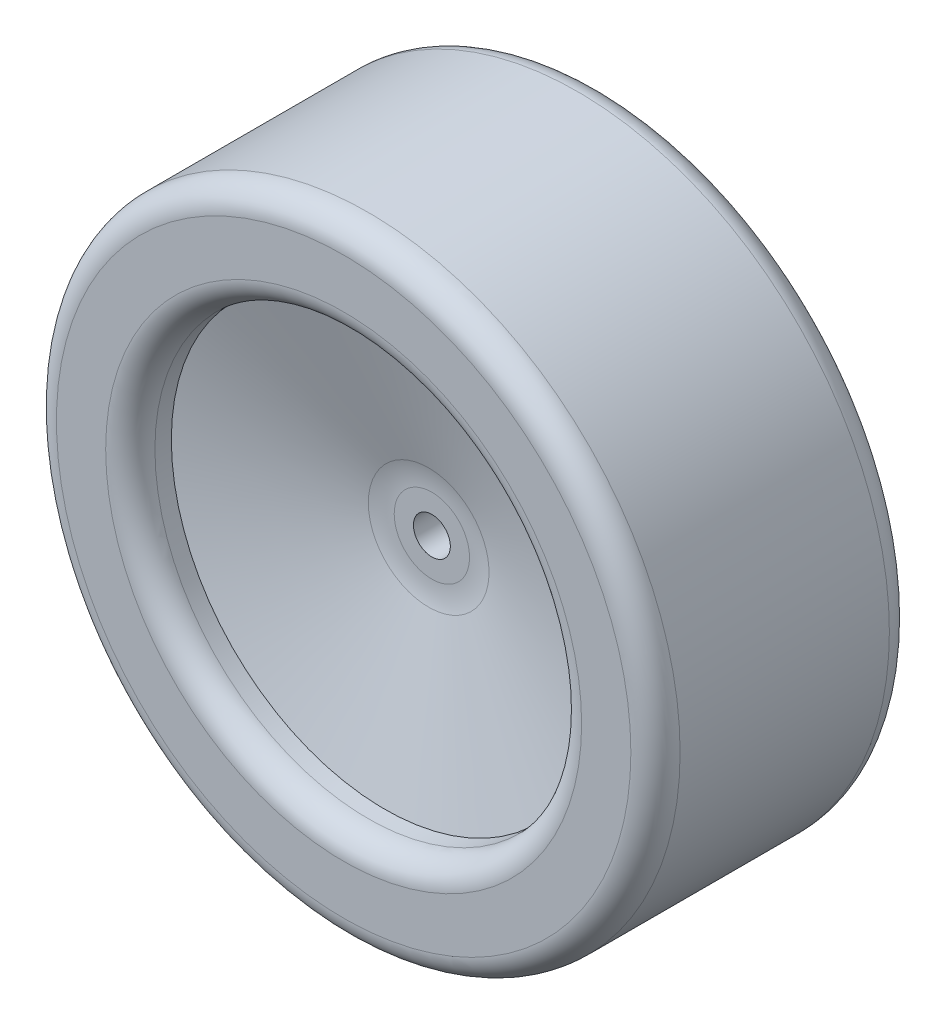
ISO-10303-21;
HEADER;
FILE_DESCRIPTION(('STEP AP214'),'2;1');
FILE_NAME('part.step','',(''),(''),'','','');
FILE_SCHEMA(('AUTOMOTIVE_DESIGN { 1 0 10303 214 1 1 1 1 }'));
ENDSEC;
DATA;
#1=APPLICATION_CONTEXT('core data for automotive mechanical design processes');
#2=APPLICATION_PROTOCOL_DEFINITION('international standard','automotive_design',2000,#1);
#3=PRODUCT_CONTEXT('',#1,'mechanical');
#4=PRODUCT('Part','Part','',(#3));
#5=PRODUCT_RELATED_PRODUCT_CATEGORY('part','',(#4));
#6=PRODUCT_DEFINITION_FORMATION('','',#4);
#7=PRODUCT_DEFINITION_CONTEXT('part definition',#1,'design');
#8=PRODUCT_DEFINITION('design','',#6,#7);
#9=PRODUCT_DEFINITION_SHAPE('','',#8);
#10=(LENGTH_UNIT() NAMED_UNIT(*) SI_UNIT(.MILLI.,.METRE.));
#11=(NAMED_UNIT(*) PLANE_ANGLE_UNIT() SI_UNIT($,.RADIAN.));
#12=(NAMED_UNIT(*) SI_UNIT($,.STERADIAN.) SOLID_ANGLE_UNIT());
#13=UNCERTAINTY_MEASURE_WITH_UNIT(LENGTH_MEASURE(1.E-05),#10,'distance_accuracy_value','');
#14=(GEOMETRIC_REPRESENTATION_CONTEXT(3) GLOBAL_UNCERTAINTY_ASSIGNED_CONTEXT((#13)) GLOBAL_UNIT_ASSIGNED_CONTEXT((#10,
#11,#12)) REPRESENTATION_CONTEXT('',''));
#15=CARTESIAN_POINT('',(0.,0.,0.));
#16=DIRECTION('',(0.,0.,1.));
#17=DIRECTION('',(1.,0.,0.));
#18=AXIS2_PLACEMENT_3D('',#15,#16,#17);
#19=CARTESIAN_POINT('',(0.,0.,5.));
#20=DIRECTION('',(0.,0.,-1.));
#21=DIRECTION('',(-1.,0.,0.));
#22=AXIS2_PLACEMENT_3D('',#19,#20,#21);
#23=PLANE('',#22);
#24=CARTESIAN_POINT('',(0.,0.,5.));
#25=DIRECTION('',(0.,0.,-1.));
#26=DIRECTION('',(-1.,0.,0.));
#27=AXIS2_PLACEMENT_3D('',#24,#25,#26);
#28=CIRCLE('',#27,4.59103691885781);
#29=CARTESIAN_POINT('',(-4.59103691885781,0.,5.));
#30=VERTEX_POINT('',#29);
#31=EDGE_CURVE('E10',#30,#30,#28,.F.);
#32=ORIENTED_EDGE('',*,*,#31,.T.);
#33=EDGE_LOOP('',(#32));
#34=FACE_BOUND('',#33,.T.);
#35=CARTESIAN_POINT('',(0.,0.,5.));
#36=DIRECTION('',(0.,0.,-1.));
#37=DIRECTION('',(-1.,0.,0.));
#38=AXIS2_PLACEMENT_3D('',#35,#36,#37);
#39=CIRCLE('',#38,2.25);
#40=CARTESIAN_POINT('',(-2.25,0.,5.));
#41=VERTEX_POINT('',#40);
#42=EDGE_CURVE('E80',#41,#41,#39,.T.);
#43=ORIENTED_EDGE('',*,*,#42,.T.);
#44=EDGE_LOOP('',(#43));
#45=FACE_BOUND('',#44,.T.);
#46=ADVANCED_FACE('F35',(#34,#45),#23,.F.);
#47=CARTESIAN_POINT('',(0.,0.,10.75));
#48=DIRECTION('',(0.,0.,1.));
#49=DIRECTION('',(1.,0.,0.));
#50=AXIS2_PLACEMENT_3D('',#47,#48,#49);
#51=CONICAL_SURFACE('',#50,26.,1.29084650427111);
#52=CARTESIAN_POINT('',(0.,0.,5.38930696070116));
#53=DIRECTION('',(0.,0.,-1.));
#54=DIRECTION('',(-1.,0.,0.));
#55=AXIS2_PLACEMENT_3D('',#52,#53,#54);
#56=CIRCLE('',#55,7.35411116765622);
#57=CARTESIAN_POINT('',(-7.35411116765622,0.,5.38930696070116));
#58=VERTEX_POINT('',#57);
#59=EDGE_CURVE('E42',#58,#58,#56,.T.);
#60=ORIENTED_EDGE('',*,*,#59,.T.);
#61=EDGE_LOOP('',(#60));
#62=FACE_BOUND('',#61,.T.);
#63=CARTESIAN_POINT('',(0.,0.,10.75));
#64=DIRECTION('',(0.,0.,-1.));
#65=DIRECTION('',(-1.,0.,0.));
#66=AXIS2_PLACEMENT_3D('',#63,#64,#65);
#67=CIRCLE('',#66,26.);
#68=CARTESIAN_POINT('',(-26.,0.,10.75));
#69=VERTEX_POINT('',#68);
#70=EDGE_CURVE('E79',#69,#69,#67,.T.);
#71=ORIENTED_EDGE('',*,*,#70,.F.);
#72=EDGE_LOOP('',(#71));
#73=FACE_BOUND('',#72,.T.);
#74=ADVANCED_FACE('F110',(#62,#73),#51,.F.);
#75=CARTESIAN_POINT('',(0.,0.,-5.));
#76=DIRECTION('',(0.,0.,-1.));
#77=DIRECTION('',(-1.,0.,0.));
#78=AXIS2_PLACEMENT_3D('',#75,#76,#77);
#79=CYLINDRICAL_SURFACE('',#78,26.);
#80=CARTESIAN_POINT('',(0.,0.,12.75));
#81=DIRECTION('',(0.,0.,1.));
#82=DIRECTION('',(1.,0.,0.));
#83=AXIS2_PLACEMENT_3D('',#80,#81,#82);
#84=CIRCLE('',#83,26.);
#85=CARTESIAN_POINT('',(26.,0.,12.75));
#86=VERTEX_POINT('',#85);
#87=EDGE_CURVE('E55',#86,#86,#84,.T.);
#88=ORIENTED_EDGE('',*,*,#87,.T.);
#89=EDGE_LOOP('',(#88));
#90=FACE_BOUND('',#89,.T.);
#91=ORIENTED_EDGE('',*,*,#70,.T.);
#92=EDGE_LOOP('',(#91));
#93=FACE_BOUND('',#92,.T.);
#94=ADVANCED_FACE('F115',(#90,#93),#79,.F.);
#95=CARTESIAN_POINT('',(0.,38.,15.75));
#96=DIRECTION('',(0.,0.,1.));
#97=DIRECTION('',(1.,0.,0.));
#98=AXIS2_PLACEMENT_3D('',#95,#96,#97);
#99=PLANE('',#98);
#100=CARTESIAN_POINT('',(0.,0.,15.75));
#101=DIRECTION('',(0.,0.,1.));
#102=DIRECTION('',(1.,0.,0.));
#103=AXIS2_PLACEMENT_3D('',#100,#101,#102);
#104=CIRCLE('',#103,29.);
#105=CARTESIAN_POINT('',(29.,0.,15.75));
#106=VERTEX_POINT('',#105);
#107=EDGE_CURVE('E58',#106,#106,#104,.F.);
#108=ORIENTED_EDGE('',*,*,#107,.T.);
#109=EDGE_LOOP('',(#108));
#110=FACE_BOUND('',#109,.T.);
#111=CARTESIAN_POINT('',(0.,0.,15.75));
#112=DIRECTION('',(0.,0.,1.));
#113=DIRECTION('',(1.,0.,0.));
#114=AXIS2_PLACEMENT_3D('',#111,#112,#113);
#115=CIRCLE('',#114,35.);
#116=CARTESIAN_POINT('',(35.,0.,15.75));
#117=VERTEX_POINT('',#116);
#118=EDGE_CURVE('E61',#117,#117,#115,.T.);
#119=ORIENTED_EDGE('',*,*,#118,.T.);
#120=EDGE_LOOP('',(#119));
#121=FACE_BOUND('',#120,.T.);
#122=ADVANCED_FACE('F160',(#110,#121),#99,.T.);
#123=CARTESIAN_POINT('',(0.,0.,-5.));
#124=DIRECTION('',(0.,0.,-1.));
#125=DIRECTION('',(-1.,0.,0.));
#126=AXIS2_PLACEMENT_3D('',#123,#124,#125);
#127=CYLINDRICAL_SURFACE('',#126,38.);
#128=CARTESIAN_POINT('',(0.,0.,-12.75));
#129=DIRECTION('',(0.,0.,1.));
#130=DIRECTION('',(1.,0.,0.));
#131=AXIS2_PLACEMENT_3D('',#128,#129,#130);
#132=CIRCLE('',#131,38.);
#133=CARTESIAN_POINT('',(38.,0.,-12.75));
#134=VERTEX_POINT('',#133);
#135=EDGE_CURVE('E64',#134,#134,#132,.T.);
#136=ORIENTED_EDGE('',*,*,#135,.T.);
#137=EDGE_LOOP('',(#136));
#138=FACE_BOUND('',#137,.T.);
#139=CARTESIAN_POINT('',(0.,0.,12.75));
#140=DIRECTION('',(0.,0.,1.));
#141=DIRECTION('',(1.,0.,0.));
#142=AXIS2_PLACEMENT_3D('',#139,#140,#141);
#143=CIRCLE('',#142,38.);
#144=CARTESIAN_POINT('',(38.,0.,12.75));
#145=VERTEX_POINT('',#144);
#146=EDGE_CURVE('E67',#145,#145,#143,.F.);
#147=ORIENTED_EDGE('',*,*,#146,.T.);
#148=EDGE_LOOP('',(#147));
#149=FACE_BOUND('',#148,.T.);
#150=ADVANCED_FACE('F154',(#138,#149),#127,.T.);
#151=CARTESIAN_POINT('',(0.,38.,-15.75));
#152=DIRECTION('',(0.,0.,1.));
#153=DIRECTION('',(1.,0.,0.));
#154=AXIS2_PLACEMENT_3D('',#151,#152,#153);
#155=PLANE('',#154);
#156=CARTESIAN_POINT('',(0.,0.,-15.75));
#157=DIRECTION('',(0.,0.,1.));
#158=DIRECTION('',(1.,0.,0.));
#159=AXIS2_PLACEMENT_3D('',#156,#157,#158);
#160=CIRCLE('',#159,29.);
#161=CARTESIAN_POINT('',(29.,0.,-15.75));
#162=VERTEX_POINT('',#161);
#163=EDGE_CURVE('E70',#162,#162,#160,.T.);
#164=ORIENTED_EDGE('',*,*,#163,.T.);
#165=EDGE_LOOP('',(#164));
#166=FACE_BOUND('',#165,.T.);
#167=CARTESIAN_POINT('',(0.,0.,-15.75));
#168=DIRECTION('',(0.,0.,1.));
#169=DIRECTION('',(1.,0.,0.));
#170=AXIS2_PLACEMENT_3D('',#167,#168,#169);
#171=CIRCLE('',#170,35.);
#172=CARTESIAN_POINT('',(35.,0.,-15.75));
#173=VERTEX_POINT('',#172);
#174=EDGE_CURVE('E73',#173,#173,#171,.F.);
#175=ORIENTED_EDGE('',*,*,#174,.T.);
#176=EDGE_LOOP('',(#175));
#177=FACE_BOUND('',#176,.T.);
#178=ADVANCED_FACE('F148',(#166,#177),#155,.F.);
#179=CARTESIAN_POINT('',(0.,0.,-5.));
#180=DIRECTION('',(0.,0.,-1.));
#181=DIRECTION('',(-1.,0.,0.));
#182=AXIS2_PLACEMENT_3D('',#179,#180,#181);
#183=CYLINDRICAL_SURFACE('',#182,26.);
#184=CARTESIAN_POINT('',(0.,0.,-12.75));
#185=DIRECTION('',(0.,0.,1.));
#186=DIRECTION('',(1.,0.,0.));
#187=AXIS2_PLACEMENT_3D('',#184,#185,#186);
#188=CIRCLE('',#187,26.);
#189=CARTESIAN_POINT('',(26.,0.,-12.75));
#190=VERTEX_POINT('',#189);
#191=EDGE_CURVE('E76',#190,#190,#188,.F.);
#192=ORIENTED_EDGE('',*,*,#191,.T.);
#193=EDGE_LOOP('',(#192));
#194=FACE_BOUND('',#193,.T.);
#195=CARTESIAN_POINT('',(0.,0.,-10.75));
#196=DIRECTION('',(0.,0.,-1.));
#197=DIRECTION('',(-1.,0.,0.));
#198=AXIS2_PLACEMENT_3D('',#195,#196,#197);
#199=CIRCLE('',#198,26.);
#200=CARTESIAN_POINT('',(-26.,0.,-10.75));
#201=VERTEX_POINT('',#200);
#202=EDGE_CURVE('E83',#201,#201,#199,.T.);
#203=ORIENTED_EDGE('',*,*,#202,.F.);
#204=EDGE_LOOP('',(#203));
#205=FACE_BOUND('',#204,.T.);
#206=ADVANCED_FACE('F106',(#194,#205),#183,.F.);
#207=CARTESIAN_POINT('',(0.,0.,-10.75));
#208=DIRECTION('',(0.,0.,-1.));
#209=DIRECTION('',(-1.,0.,0.));
#210=AXIS2_PLACEMENT_3D('',#207,#208,#209);
#211=CONICAL_SURFACE('',#210,26.,1.29084650427111);
#212=CARTESIAN_POINT('',(0.,0.,-5.38930696070117));
#213=DIRECTION('',(0.,0.,1.));
#214=DIRECTION('',(1.,0.,0.));
#215=AXIS2_PLACEMENT_3D('',#212,#213,#214);
#216=CIRCLE('',#215,7.35411116765622);
#217=CARTESIAN_POINT('',(7.35411116765622,0.,-5.38930696070117));
#218=VERTEX_POINT('',#217);
#219=EDGE_CURVE('E46',#218,#218,#216,.T.);
#220=ORIENTED_EDGE('',*,*,#219,.T.);
#221=EDGE_LOOP('',(#220));
#222=FACE_BOUND('',#221,.T.);
#223=ORIENTED_EDGE('',*,*,#202,.T.);
#224=EDGE_LOOP('',(#223));
#225=FACE_BOUND('',#224,.T.);
#226=ADVANCED_FACE('F97',(#222,#225),#211,.F.);
#227=CARTESIAN_POINT('',(0.,0.,-5.));
#228=DIRECTION('',(0.,0.,-1.));
#229=DIRECTION('',(-1.,0.,0.));
#230=AXIS2_PLACEMENT_3D('',#227,#228,#229);
#231=PLANE('',#230);
#232=CARTESIAN_POINT('',(0.,0.,-5.));
#233=DIRECTION('',(0.,0.,-1.));
#234=DIRECTION('',(-1.,0.,0.));
#235=AXIS2_PLACEMENT_3D('',#232,#233,#234);
#236=CIRCLE('',#235,4.59103691885781);
#237=CARTESIAN_POINT('',(-4.59103691885781,0.,-5.));
#238=VERTEX_POINT('',#237);
#239=EDGE_CURVE('E50',#238,#238,#236,.T.);
#240=ORIENTED_EDGE('',*,*,#239,.T.);
#241=EDGE_LOOP('',(#240));
#242=FACE_BOUND('',#241,.T.);
#243=CARTESIAN_POINT('',(0.,0.,-5.));
#244=DIRECTION('',(0.,0.,-1.));
#245=DIRECTION('',(-1.,0.,0.));
#246=AXIS2_PLACEMENT_3D('',#243,#244,#245);
#247=CIRCLE('',#246,2.25);
#248=CARTESIAN_POINT('',(-2.25,0.,-5.));
#249=VERTEX_POINT('',#248);
#250=EDGE_CURVE('E84',#249,#249,#247,.T.);
#251=ORIENTED_EDGE('',*,*,#250,.F.);
#252=EDGE_LOOP('',(#251));
#253=FACE_BOUND('',#252,.T.);
#254=ADVANCED_FACE('F95',(#242,#253),#231,.T.);
#255=CARTESIAN_POINT('',(0.,0.,15.75));
#256=DIRECTION('',(0.,0.,-1.));
#257=DIRECTION('',(-1.,0.,0.));
#258=AXIS2_PLACEMENT_3D('',#255,#256,#257);
#259=CYLINDRICAL_SURFACE('',#258,2.25);
#260=ORIENTED_EDGE('',*,*,#250,.T.);
#261=EDGE_LOOP('',(#260));
#262=FACE_BOUND('',#261,.T.);
#263=ORIENTED_EDGE('',*,*,#42,.F.);
#264=EDGE_LOOP('',(#263));
#265=FACE_BOUND('',#264,.T.);
#266=ADVANCED_FACE('F92',(#262,#265),#259,.F.);
#267=CARTESIAN_POINT('',(0.,0.,-12.75));
#268=DIRECTION('',(0.,0.,1.));
#269=DIRECTION('',(1.,0.,0.));
#270=AXIS2_PLACEMENT_3D('',#267,#268,#269);
#271=TOROIDAL_SURFACE('',#270,29.,3.);
#272=ORIENTED_EDGE('',*,*,#163,.F.);
#273=EDGE_LOOP('',(#272));
#274=FACE_BOUND('',#273,.T.);
#275=ORIENTED_EDGE('',*,*,#191,.F.);
#276=EDGE_LOOP('',(#275));
#277=FACE_BOUND('',#276,.T.);
#278=ADVANCED_FACE('F104',(#274,#277),#271,.T.);
#279=CARTESIAN_POINT('',(0.,0.,-12.75));
#280=DIRECTION('',(0.,0.,1.));
#281=DIRECTION('',(1.,0.,0.));
#282=AXIS2_PLACEMENT_3D('',#279,#280,#281);
#283=TOROIDAL_SURFACE('',#282,35.,3.);
#284=ORIENTED_EDGE('',*,*,#135,.F.);
#285=EDGE_LOOP('',(#284));
#286=FACE_BOUND('',#285,.T.);
#287=ORIENTED_EDGE('',*,*,#174,.F.);
#288=EDGE_LOOP('',(#287));
#289=FACE_BOUND('',#288,.T.);
#290=ADVANCED_FACE('F122',(#286,#289),#283,.T.);
#291=CARTESIAN_POINT('',(0.,0.,12.75));
#292=DIRECTION('',(0.,0.,1.));
#293=DIRECTION('',(1.,0.,0.));
#294=AXIS2_PLACEMENT_3D('',#291,#292,#293);
#295=TOROIDAL_SURFACE('',#294,29.,3.);
#296=ORIENTED_EDGE('',*,*,#87,.F.);
#297=EDGE_LOOP('',(#296));
#298=FACE_BOUND('',#297,.T.);
#299=ORIENTED_EDGE('',*,*,#107,.F.);
#300=EDGE_LOOP('',(#299));
#301=FACE_BOUND('',#300,.T.);
#302=ADVANCED_FACE('F126',(#298,#301),#295,.T.);
#303=CARTESIAN_POINT('',(0.,0.,12.75));
#304=DIRECTION('',(0.,0.,1.));
#305=DIRECTION('',(1.,0.,0.));
#306=AXIS2_PLACEMENT_3D('',#303,#304,#305);
#307=TOROIDAL_SURFACE('',#306,35.,3.);
#308=ORIENTED_EDGE('',*,*,#118,.F.);
#309=EDGE_LOOP('',(#308));
#310=FACE_BOUND('',#309,.T.);
#311=ORIENTED_EDGE('',*,*,#146,.F.);
#312=EDGE_LOOP('',(#311));
#313=FACE_BOUND('',#312,.T.);
#314=ADVANCED_FACE('F130',(#310,#313),#307,.T.);
#315=CARTESIAN_POINT('',(0.,0.,-15.));
#316=DIRECTION('',(0.,0.,-1.));
#317=DIRECTION('',(-1.,0.,0.));
#318=AXIS2_PLACEMENT_3D('',#315,#316,#317);
#319=DEGENERATE_TOROIDAL_SURFACE('',#318,4.59103691885781,10.,.T.);
#320=ORIENTED_EDGE('',*,*,#219,.F.);
#321=EDGE_LOOP('',(#320));
#322=FACE_BOUND('',#321,.T.);
#323=ORIENTED_EDGE('',*,*,#239,.F.);
#324=EDGE_LOOP('',(#323));
#325=FACE_BOUND('',#324,.T.);
#326=ADVANCED_FACE('F133',(#322,#325),#319,.F.);
#327=CARTESIAN_POINT('',(0.,0.,15.));
#328=DIRECTION('',(0.,0.,-1.));
#329=DIRECTION('',(-1.,0.,0.));
#330=AXIS2_PLACEMENT_3D('',#327,#328,#329);
#331=DEGENERATE_TOROIDAL_SURFACE('',#330,4.59103691885781,10.,.T.);
#332=ORIENTED_EDGE('',*,*,#31,.F.);
#333=EDGE_LOOP('',(#332));
#334=FACE_BOUND('',#333,.T.);
#335=ORIENTED_EDGE('',*,*,#59,.F.);
#336=EDGE_LOOP('',(#335));
#337=FACE_BOUND('',#336,.T.);
#338=ADVANCED_FACE('F37',(#334,#337),#331,.F.);
#339=CLOSED_SHELL('',(#46,#74,#94,#122,#150,#178,#206,#226,#254,#266,#278,#290,#302,#314,#326,#338));
#340=MANIFOLD_SOLID_BREP('B2',#339);
#341=ADVANCED_BREP_SHAPE_REPRESENTATION('',(#18,#340),#14);
#342=SHAPE_DEFINITION_REPRESENTATION(#9,#341);
ENDSEC;
END-ISO-10303-21;
